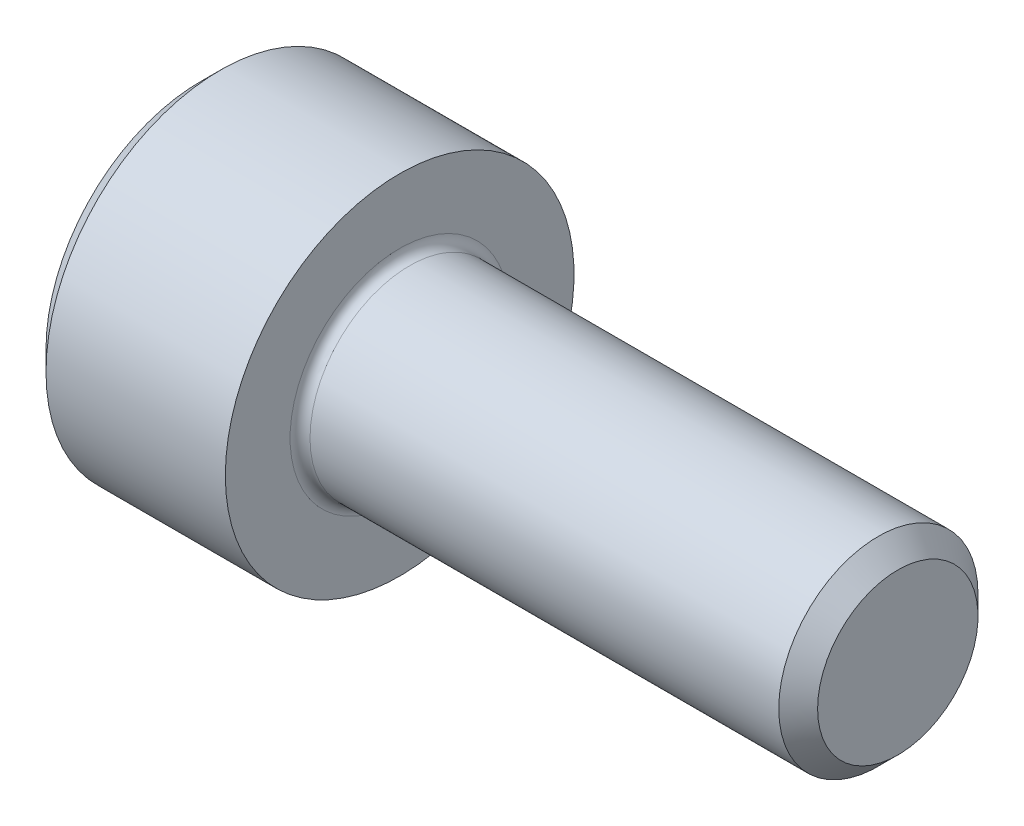
ISO-10303-21;
HEADER;
FILE_DESCRIPTION(('STEP AP214'),'2;1');
FILE_NAME('part.step','',(''),(''),'','','');
FILE_SCHEMA(('AUTOMOTIVE_DESIGN { 1 0 10303 214 1 1 1 1 }'));
ENDSEC;
DATA;
#1=APPLICATION_CONTEXT('core data for automotive mechanical design processes');
#2=APPLICATION_PROTOCOL_DEFINITION('international standard','automotive_design',2000,#1);
#3=PRODUCT_CONTEXT('',#1,'mechanical');
#4=PRODUCT('Part','Part','',(#3));
#5=PRODUCT_RELATED_PRODUCT_CATEGORY('part','',(#4));
#6=PRODUCT_DEFINITION_FORMATION('','',#4);
#7=PRODUCT_DEFINITION_CONTEXT('part definition',#1,'design');
#8=PRODUCT_DEFINITION('design','',#6,#7);
#9=PRODUCT_DEFINITION_SHAPE('','',#8);
#10=(LENGTH_UNIT() NAMED_UNIT(*) SI_UNIT(.MILLI.,.METRE.));
#11=(NAMED_UNIT(*) PLANE_ANGLE_UNIT() SI_UNIT($,.RADIAN.));
#12=(NAMED_UNIT(*) SI_UNIT($,.STERADIAN.) SOLID_ANGLE_UNIT());
#13=UNCERTAINTY_MEASURE_WITH_UNIT(LENGTH_MEASURE(1.E-05),#10,'distance_accuracy_value','');
#14=(GEOMETRIC_REPRESENTATION_CONTEXT(3) GLOBAL_UNCERTAINTY_ASSIGNED_CONTEXT((#13)) GLOBAL_UNIT_ASSIGNED_CONTEXT((#10,
#11,#12)) REPRESENTATION_CONTEXT('',''));
#15=CARTESIAN_POINT('',(0.,0.,0.));
#16=DIRECTION('',(0.,0.,1.));
#17=DIRECTION('',(1.,0.,0.));
#18=AXIS2_PLACEMENT_3D('',#15,#16,#17);
#19=CARTESIAN_POINT('',(0.,0.,0.));
#20=DIRECTION('',(-1.,0.,0.));
#21=DIRECTION('',(0.,0.,1.));
#22=AXIS2_PLACEMENT_3D('',#19,#20,#21);
#23=PLANE('',#22);
#24=DIRECTION('',(0.,-0.5,0.866025403784438));
#25=VECTOR('',#24,1.);
#26=CARTESIAN_POINT('',(0.,1.77304267668134,0.));
#27=LINE('',#26,#25);
#28=CARTESIAN_POINT('',(0.,1.77304267668134,0.));
#29=VERTEX_POINT('',#28);
#30=CARTESIAN_POINT('',(0.,0.886521338340669,1.5355));
#31=VERTEX_POINT('',#30);
#32=EDGE_CURVE('E386',#29,#31,#27,.T.);
#33=ORIENTED_EDGE('',*,*,#32,.T.);
#34=DIRECTION('',(0.,1.,0.));
#35=VECTOR('',#34,1.);
#36=CARTESIAN_POINT('',(0.,-0.886521338340673,1.5355));
#37=LINE('',#36,#35);
#38=CARTESIAN_POINT('',(0.,-0.886521338340673,1.5355));
#39=VERTEX_POINT('',#38);
#40=EDGE_CURVE('E130',#39,#31,#37,.T.);
#41=ORIENTED_EDGE('',*,*,#40,.F.);
#42=DIRECTION('',(0.,-0.500000000000001,-0.866025403784438));
#43=VECTOR('',#42,1.);
#44=CARTESIAN_POINT('',(0.,-0.886521338340673,1.5355));
#45=LINE('',#44,#43);
#46=CARTESIAN_POINT('',(0.,-1.77304267668135,0.));
#47=VERTEX_POINT('',#46);
#48=EDGE_CURVE('E389',#39,#47,#45,.T.);
#49=ORIENTED_EDGE('',*,*,#48,.T.);
#50=DIRECTION('',(0.,0.5,-0.866025403784439));
#51=VECTOR('',#50,1.);
#52=CARTESIAN_POINT('',(0.,-1.77304267668135,0.));
#53=LINE('',#52,#51);
#54=CARTESIAN_POINT('',(0.,-0.886521338340675,-1.5355));
#55=VERTEX_POINT('',#54);
#56=EDGE_CURVE('E392',#47,#55,#53,.T.);
#57=ORIENTED_EDGE('',*,*,#56,.T.);
#58=DIRECTION('',(0.,-1.,0.));
#59=VECTOR('',#58,1.);
#60=CARTESIAN_POINT('',(0.,0.886521338340666,-1.5355));
#61=LINE('',#60,#59);
#62=CARTESIAN_POINT('',(0.,0.886521338340666,-1.5355));
#63=VERTEX_POINT('',#62);
#64=EDGE_CURVE('E395',#63,#55,#61,.T.);
#65=ORIENTED_EDGE('',*,*,#64,.F.);
#66=DIRECTION('',(0.,-0.500000000000001,-0.866025403784438));
#67=VECTOR('',#66,1.);
#68=CARTESIAN_POINT('',(0.,1.77304267668134,0.));
#69=LINE('',#68,#67);
#70=EDGE_CURVE('E125',#29,#63,#69,.T.);
#71=ORIENTED_EDGE('',*,*,#70,.F.);
#72=EDGE_LOOP('',(#33,#41,#49,#57,#65,#71));
#73=FACE_BOUND('',#72,.T.);
#74=CARTESIAN_POINT('',(0.,0.,0.));
#75=DIRECTION('',(-1.,0.,0.));
#76=DIRECTION('',(0.,0.,1.));
#77=AXIS2_PLACEMENT_3D('',#74,#75,#76);
#78=CIRCLE('',#77,3.1);
#79=CARTESIAN_POINT('',(0.,0.,3.1));
#80=VERTEX_POINT('',#79);
#81=EDGE_CURVE('E141',#80,#80,#78,.T.);
#82=ORIENTED_EDGE('',*,*,#81,.T.);
#83=EDGE_LOOP('',(#82));
#84=FACE_BOUND('',#83,.T.);
#85=ADVANCED_FACE('F34',(#73,#84),#23,.T.);
#86=CARTESIAN_POINT('',(14.,1.61,0.));
#87=DIRECTION('',(1.,0.,0.));
#88=DIRECTION('',(0.,0.,-1.));
#89=AXIS2_PLACEMENT_3D('',#86,#87,#88);
#90=PLANE('',#89);
#91=CARTESIAN_POINT('',(14.,0.,0.));
#92=DIRECTION('',(-1.,0.,0.));
#93=DIRECTION('',(0.,0.,1.));
#94=AXIS2_PLACEMENT_3D('',#91,#92,#93);
#95=CIRCLE('',#94,1.61);
#96=CARTESIAN_POINT('',(14.,0.,1.61));
#97=VERTEX_POINT('',#96);
#98=EDGE_CURVE('E154',#97,#97,#95,.T.);
#99=ORIENTED_EDGE('',*,*,#98,.F.);
#100=EDGE_LOOP('',(#99));
#101=FACE_BOUND('',#100,.T.);
#102=ADVANCED_FACE('F175',(#101),#90,.T.);
#103=CARTESIAN_POINT('',(14.,0.,0.));
#104=DIRECTION('',(-1.,0.,0.));
#105=DIRECTION('',(0.,0.,1.));
#106=AXIS2_PLACEMENT_3D('',#103,#104,#105);
#107=CONICAL_SURFACE('',#106,1.61,0.785398163397184);
#108=CARTESIAN_POINT('',(13.6099999999999,0.,0.));
#109=DIRECTION('',(-1.,0.,0.));
#110=DIRECTION('',(0.,0.,1.));
#111=AXIS2_PLACEMENT_3D('',#108,#109,#110);
#112=CIRCLE('',#111,1.99999999999989);
#113=CARTESIAN_POINT('',(13.6099999999999,0.,1.99999999999989));
#114=VERTEX_POINT('',#113);
#115=EDGE_CURVE('E151',#114,#114,#112,.T.);
#116=ORIENTED_EDGE('',*,*,#115,.F.);
#117=EDGE_LOOP('',(#116));
#118=FACE_BOUND('',#117,.T.);
#119=ORIENTED_EDGE('',*,*,#98,.T.);
#120=EDGE_LOOP('',(#119));
#121=FACE_BOUND('',#120,.T.);
#122=ADVANCED_FACE('F181',(#118,#121),#107,.T.);
#123=CARTESIAN_POINT('',(-31.75,0.,0.));
#124=DIRECTION('',(-1.,0.,0.));
#125=DIRECTION('',(0.,0.,1.));
#126=AXIS2_PLACEMENT_3D('',#123,#124,#125);
#127=CYLINDRICAL_SURFACE('',#126,1.99999999999995);
#128=CARTESIAN_POINT('',(4.2,0.,0.));
#129=DIRECTION('',(1.,0.,0.));
#130=DIRECTION('',(0.,0.,-1.));
#131=AXIS2_PLACEMENT_3D('',#128,#129,#130);
#132=CIRCLE('',#131,1.99999999999995);
#133=CARTESIAN_POINT('',(4.2,0.,-1.99999999999995));
#134=VERTEX_POINT('',#133);
#135=EDGE_CURVE('E11',#134,#134,#132,.T.);
#136=ORIENTED_EDGE('',*,*,#135,.T.);
#137=EDGE_LOOP('',(#136));
#138=FACE_BOUND('',#137,.T.);
#139=ORIENTED_EDGE('',*,*,#115,.T.);
#140=EDGE_LOOP('',(#139));
#141=FACE_BOUND('',#140,.T.);
#142=ADVANCED_FACE('F192',(#138,#141),#127,.T.);
#143=CARTESIAN_POINT('',(4.,3.5,0.));
#144=DIRECTION('',(1.,0.,0.));
#145=DIRECTION('',(0.,0.,-1.));
#146=AXIS2_PLACEMENT_3D('',#143,#144,#145);
#147=PLANE('',#146);
#148=CARTESIAN_POINT('',(4.,0.,0.));
#149=DIRECTION('',(1.,0.,0.));
#150=DIRECTION('',(0.,0.,-1.));
#151=AXIS2_PLACEMENT_3D('',#148,#149,#150);
#152=CIRCLE('',#151,2.19999999999995);
#153=CARTESIAN_POINT('',(4.,0.,-2.19999999999995));
#154=VERTEX_POINT('',#153);
#155=EDGE_CURVE('E42',#154,#154,#152,.F.);
#156=ORIENTED_EDGE('',*,*,#155,.T.);
#157=EDGE_LOOP('',(#156));
#158=FACE_BOUND('',#157,.T.);
#159=CARTESIAN_POINT('',(4.,0.,0.));
#160=DIRECTION('',(-1.,0.,0.));
#161=DIRECTION('',(0.,0.,1.));
#162=AXIS2_PLACEMENT_3D('',#159,#160,#161);
#163=CIRCLE('',#162,3.5);
#164=CARTESIAN_POINT('',(4.,0.,3.5));
#165=VERTEX_POINT('',#164);
#166=EDGE_CURVE('E148',#165,#165,#163,.T.);
#167=ORIENTED_EDGE('',*,*,#166,.F.);
#168=EDGE_LOOP('',(#167));
#169=FACE_BOUND('',#168,.T.);
#170=ADVANCED_FACE('F159',(#158,#169),#147,.T.);
#171=CARTESIAN_POINT('',(-31.75,0.,0.));
#172=DIRECTION('',(-1.,0.,0.));
#173=DIRECTION('',(0.,0.,1.));
#174=AXIS2_PLACEMENT_3D('',#171,#172,#173);
#175=CYLINDRICAL_SURFACE('',#174,3.5);
#176=ORIENTED_EDGE('',*,*,#166,.T.);
#177=EDGE_LOOP('',(#176));
#178=FACE_BOUND('',#177,.T.);
#179=CARTESIAN_POINT('',(0.399999999999998,0.,0.));
#180=DIRECTION('',(-1.,0.,0.));
#181=DIRECTION('',(0.,0.,1.));
#182=AXIS2_PLACEMENT_3D('',#179,#180,#181);
#183=CIRCLE('',#182,3.5);
#184=CARTESIAN_POINT('',(0.399999999999998,0.,3.5));
#185=VERTEX_POINT('',#184);
#186=EDGE_CURVE('E145',#185,#185,#183,.T.);
#187=ORIENTED_EDGE('',*,*,#186,.F.);
#188=EDGE_LOOP('',(#187));
#189=FACE_BOUND('',#188,.T.);
#190=ADVANCED_FACE('F170',(#178,#189),#175,.T.);
#191=CARTESIAN_POINT('',(0.,0.,0.));
#192=DIRECTION('',(1.,0.,0.));
#193=DIRECTION('',(0.,0.,-1.));
#194=AXIS2_PLACEMENT_3D('',#191,#192,#193);
#195=CONICAL_SURFACE('',#194,3.1,0.78539816339745);
#196=ORIENTED_EDGE('',*,*,#186,.T.);
#197=EDGE_LOOP('',(#196));
#198=FACE_BOUND('',#197,.T.);
#199=ORIENTED_EDGE('',*,*,#81,.F.);
#200=EDGE_LOOP('',(#199));
#201=FACE_BOUND('',#200,.T.);
#202=ADVANCED_FACE('F163',(#198,#201),#195,.T.);
#203=CARTESIAN_POINT('',(4.2,0.,0.));
#204=DIRECTION('',(1.,0.,0.));
#205=DIRECTION('',(0.,0.,-1.));
#206=AXIS2_PLACEMENT_3D('',#203,#204,#205);
#207=TOROIDAL_SURFACE('',#206,2.19999999999995,0.2);
#208=ORIENTED_EDGE('',*,*,#135,.F.);
#209=EDGE_LOOP('',(#208));
#210=FACE_BOUND('',#209,.T.);
#211=ORIENTED_EDGE('',*,*,#155,.F.);
#212=EDGE_LOOP('',(#211));
#213=FACE_BOUND('',#212,.T.);
#214=ADVANCED_FACE('F36',(#210,#213),#207,.F.);
#215=CARTESIAN_POINT('',(2.,1.77304267668134,0.));
#216=DIRECTION('',(0.,-0.866025403784439,-0.5));
#217=DIRECTION('',(0.,0.5,-0.866025403784438));
#218=AXIS2_PLACEMENT_3D('',#215,#216,#217);
#219=PLANE('',#218);
#220=ORIENTED_EDGE('',*,*,#32,.F.);
#221=DIRECTION('',(-1.,0.,0.));
#222=VECTOR('',#221,1.);
#223=CARTESIAN_POINT('',(2.,1.77304267668134,0.));
#224=LINE('',#223,#222);
#225=CARTESIAN_POINT('',(2.,1.77304267668134,0.));
#226=VERTEX_POINT('',#225);
#227=EDGE_CURVE('E376',#226,#29,#224,.T.);
#228=ORIENTED_EDGE('',*,*,#227,.F.);
#229=DIRECTION('',(0.,-0.5,0.866025403784438));
#230=VECTOR('',#229,1.);
#231=CARTESIAN_POINT('',(2.,1.77304267668134,0.));
#232=LINE('',#231,#230);
#233=CARTESIAN_POINT('',(2.,1.329782007511,0.767749999999999));
#234=VERTEX_POINT('',#233);
#235=EDGE_CURVE('E117',#226,#234,#232,.T.);
#236=ORIENTED_EDGE('',*,*,#235,.T.);
#237=CARTESIAN_POINT('',(2.,0.886521338340669,1.5355));
#238=VERTEX_POINT('',#237);
#239=EDGE_CURVE('E108',#234,#238,#232,.T.);
#240=ORIENTED_EDGE('',*,*,#239,.T.);
#241=DIRECTION('',(-1.,0.,0.));
#242=VECTOR('',#241,1.);
#243=CARTESIAN_POINT('',(2.,0.886521338340669,1.5355));
#244=LINE('',#243,#242);
#245=EDGE_CURVE('E122',#238,#31,#244,.T.);
#246=ORIENTED_EDGE('',*,*,#245,.T.);
#247=EDGE_LOOP('',(#220,#228,#236,#240,#246));
#248=FACE_BOUND('',#247,.T.);
#249=ADVANCED_FACE('F121',(#248),#219,.T.);
#250=CARTESIAN_POINT('',(2.,-0.886521338340673,1.5355));
#251=DIRECTION('',(0.,0.,1.));
#252=DIRECTION('',(0.,-1.,0.));
#253=AXIS2_PLACEMENT_3D('',#250,#251,#252);
#254=PLANE('',#253);
#255=ORIENTED_EDGE('',*,*,#40,.T.);
#256=ORIENTED_EDGE('',*,*,#245,.F.);
#257=DIRECTION('',(0.,1.,0.));
#258=VECTOR('',#257,1.);
#259=CARTESIAN_POINT('',(2.,-0.886521338340673,1.5355));
#260=LINE('',#259,#258);
#261=CARTESIAN_POINT('',(2.,0.,1.5355));
#262=VERTEX_POINT('',#261);
#263=EDGE_CURVE('E105',#262,#238,#260,.T.);
#264=ORIENTED_EDGE('',*,*,#263,.F.);
#265=CARTESIAN_POINT('',(2.,-0.886521338340673,1.5355));
#266=VERTEX_POINT('',#265);
#267=EDGE_CURVE('E116',#266,#262,#260,.T.);
#268=ORIENTED_EDGE('',*,*,#267,.F.);
#269=DIRECTION('',(-1.,0.,0.));
#270=VECTOR('',#269,1.);
#271=CARTESIAN_POINT('',(2.,-0.886521338340673,1.5355));
#272=LINE('',#271,#270);
#273=EDGE_CURVE('E132',#266,#39,#272,.T.);
#274=ORIENTED_EDGE('',*,*,#273,.T.);
#275=EDGE_LOOP('',(#255,#256,#264,#268,#274));
#276=FACE_BOUND('',#275,.T.);
#277=ADVANCED_FACE('F127',(#276),#254,.F.);
#278=CARTESIAN_POINT('',(2.,-0.886521338340673,1.5355));
#279=DIRECTION('',(0.,0.866025403784438,-0.500000000000001));
#280=DIRECTION('',(0.,0.500000000000001,0.866025403784438));
#281=AXIS2_PLACEMENT_3D('',#278,#279,#280);
#282=PLANE('',#281);
#283=ORIENTED_EDGE('',*,*,#48,.F.);
#284=ORIENTED_EDGE('',*,*,#273,.F.);
#285=DIRECTION('',(0.,-0.500000000000001,-0.866025403784438));
#286=VECTOR('',#285,1.);
#287=CARTESIAN_POINT('',(2.,-0.886521338340673,1.5355));
#288=LINE('',#287,#286);
#289=CARTESIAN_POINT('',(2.,-1.32978200751101,0.767750000000003));
#290=VERTEX_POINT('',#289);
#291=EDGE_CURVE('E415',#266,#290,#288,.T.);
#292=ORIENTED_EDGE('',*,*,#291,.T.);
#293=CARTESIAN_POINT('',(2.,-1.77304267668135,0.));
#294=VERTEX_POINT('',#293);
#295=EDGE_CURVE('E404',#290,#294,#288,.T.);
#296=ORIENTED_EDGE('',*,*,#295,.T.);
#297=DIRECTION('',(-1.,0.,0.));
#298=VECTOR('',#297,1.);
#299=CARTESIAN_POINT('',(2.,-1.77304267668135,0.));
#300=LINE('',#299,#298);
#301=EDGE_CURVE('E137',#294,#47,#300,.T.);
#302=ORIENTED_EDGE('',*,*,#301,.T.);
#303=EDGE_LOOP('',(#283,#284,#292,#296,#302));
#304=FACE_BOUND('',#303,.T.);
#305=ADVANCED_FACE('F267',(#304),#282,.T.);
#306=CARTESIAN_POINT('',(2.,-1.77304267668135,0.));
#307=DIRECTION('',(0.,0.866025403784439,0.5));
#308=DIRECTION('',(0.,-0.5,0.866025403784439));
#309=AXIS2_PLACEMENT_3D('',#306,#307,#308);
#310=PLANE('',#309);
#311=ORIENTED_EDGE('',*,*,#56,.F.);
#312=ORIENTED_EDGE('',*,*,#301,.F.);
#313=DIRECTION('',(0.,0.5,-0.866025403784439));
#314=VECTOR('',#313,1.);
#315=CARTESIAN_POINT('',(2.,-1.77304267668135,0.));
#316=LINE('',#315,#314);
#317=CARTESIAN_POINT('',(2.,-1.32978200751101,-0.767750000000002));
#318=VERTEX_POINT('',#317);
#319=EDGE_CURVE('E382',#294,#318,#316,.T.);
#320=ORIENTED_EDGE('',*,*,#319,.T.);
#321=CARTESIAN_POINT('',(2.,-0.886521338340675,-1.5355));
#322=VERTEX_POINT('',#321);
#323=EDGE_CURVE('E414',#318,#322,#316,.T.);
#324=ORIENTED_EDGE('',*,*,#323,.T.);
#325=DIRECTION('',(-1.,0.,0.));
#326=VECTOR('',#325,1.);
#327=CARTESIAN_POINT('',(2.,-0.886521338340675,-1.5355));
#328=LINE('',#327,#326);
#329=EDGE_CURVE('E375',#322,#55,#328,.T.);
#330=ORIENTED_EDGE('',*,*,#329,.T.);
#331=EDGE_LOOP('',(#311,#312,#320,#324,#330));
#332=FACE_BOUND('',#331,.T.);
#333=ADVANCED_FACE('F275',(#332),#310,.T.);
#334=CARTESIAN_POINT('',(2.,0.886521338340666,-1.5355));
#335=DIRECTION('',(0.,0.,-1.));
#336=DIRECTION('',(0.,1.,0.));
#337=AXIS2_PLACEMENT_3D('',#334,#335,#336);
#338=PLANE('',#337);
#339=ORIENTED_EDGE('',*,*,#64,.T.);
#340=ORIENTED_EDGE('',*,*,#329,.F.);
#341=DIRECTION('',(0.,-1.,0.));
#342=VECTOR('',#341,1.);
#343=CARTESIAN_POINT('',(2.,0.886521338340666,-1.5355));
#344=LINE('',#343,#342);
#345=CARTESIAN_POINT('',(2.,0.,-1.5355));
#346=VERTEX_POINT('',#345);
#347=EDGE_CURVE('E379',#346,#322,#344,.T.);
#348=ORIENTED_EDGE('',*,*,#347,.F.);
#349=CARTESIAN_POINT('',(2.,0.886521338340666,-1.5355));
#350=VERTEX_POINT('',#349);
#351=EDGE_CURVE('E49',#350,#346,#344,.T.);
#352=ORIENTED_EDGE('',*,*,#351,.F.);
#353=DIRECTION('',(-1.,0.,0.));
#354=VECTOR('',#353,1.);
#355=CARTESIAN_POINT('',(2.,0.886521338340666,-1.5355));
#356=LINE('',#355,#354);
#357=EDGE_CURVE('E372',#350,#63,#356,.T.);
#358=ORIENTED_EDGE('',*,*,#357,.T.);
#359=EDGE_LOOP('',(#339,#340,#348,#352,#358));
#360=FACE_BOUND('',#359,.T.);
#361=ADVANCED_FACE('F284',(#360),#338,.F.);
#362=CARTESIAN_POINT('',(2.,1.77304267668134,0.));
#363=DIRECTION('',(0.,0.866025403784438,-0.500000000000001));
#364=DIRECTION('',(0.,0.500000000000001,0.866025403784438));
#365=AXIS2_PLACEMENT_3D('',#362,#363,#364);
#366=PLANE('',#365);
#367=ORIENTED_EDGE('',*,*,#70,.T.);
#368=ORIENTED_EDGE('',*,*,#357,.F.);
#369=DIRECTION('',(0.,-0.500000000000001,-0.866025403784438));
#370=VECTOR('',#369,1.);
#371=CARTESIAN_POINT('',(2.,1.77304267668134,0.));
#372=LINE('',#371,#370);
#373=CARTESIAN_POINT('',(2.,1.329782007511,-0.767750000000002));
#374=VERTEX_POINT('',#373);
#375=EDGE_CURVE('E362',#374,#350,#372,.T.);
#376=ORIENTED_EDGE('',*,*,#375,.F.);
#377=EDGE_CURVE('E368',#226,#374,#372,.T.);
#378=ORIENTED_EDGE('',*,*,#377,.F.);
#379=ORIENTED_EDGE('',*,*,#227,.T.);
#380=EDGE_LOOP('',(#367,#368,#376,#378,#379));
#381=FACE_BOUND('',#380,.T.);
#382=ADVANCED_FACE('F293',(#381),#366,.F.);
#383=CARTESIAN_POINT('',(2.,1.77304267668134,0.));
#384=DIRECTION('',(1.,0.,0.));
#385=DIRECTION('',(0.,0.,-1.));
#386=AXIS2_PLACEMENT_3D('',#383,#384,#385);
#387=PLANE('',#386);
#388=ORIENTED_EDGE('',*,*,#347,.T.);
#389=ORIENTED_EDGE('',*,*,#323,.F.);
#390=CARTESIAN_POINT('',(2.,0.,0.));
#391=DIRECTION('',(-1.,0.,0.));
#392=DIRECTION('',(0.,0.,1.));
#393=AXIS2_PLACEMENT_3D('',#390,#391,#392);
#394=CIRCLE('',#393,1.5355);
#395=EDGE_CURVE('E410',#346,#318,#394,.T.);
#396=ORIENTED_EDGE('',*,*,#395,.F.);
#397=EDGE_LOOP('',(#388,#389,#396));
#398=FACE_BOUND('',#397,.T.);
#399=ADVANCED_FACE('F302',(#398),#387,.F.);
#400=ORIENTED_EDGE('',*,*,#319,.F.);
#401=ORIENTED_EDGE('',*,*,#295,.F.);
#402=EDGE_CURVE('E135',#318,#290,#394,.T.);
#403=ORIENTED_EDGE('',*,*,#402,.F.);
#404=EDGE_LOOP('',(#400,#401,#403));
#405=FACE_BOUND('',#404,.T.);
#406=ADVANCED_FACE('F311',(#405),#387,.F.);
#407=ORIENTED_EDGE('',*,*,#291,.F.);
#408=ORIENTED_EDGE('',*,*,#267,.T.);
#409=EDGE_CURVE('E131',#290,#262,#394,.T.);
#410=ORIENTED_EDGE('',*,*,#409,.F.);
#411=EDGE_LOOP('',(#407,#408,#410));
#412=FACE_BOUND('',#411,.T.);
#413=ADVANCED_FACE('F320',(#412),#387,.F.);
#414=ORIENTED_EDGE('',*,*,#263,.T.);
#415=ORIENTED_EDGE('',*,*,#239,.F.);
#416=EDGE_CURVE('E111',#262,#234,#394,.T.);
#417=ORIENTED_EDGE('',*,*,#416,.F.);
#418=EDGE_LOOP('',(#414,#415,#417));
#419=FACE_BOUND('',#418,.T.);
#420=ADVANCED_FACE('F107',(#419),#387,.F.);
#421=ORIENTED_EDGE('',*,*,#235,.F.);
#422=ORIENTED_EDGE('',*,*,#377,.T.);
#423=EDGE_CURVE('E142',#234,#374,#394,.T.);
#424=ORIENTED_EDGE('',*,*,#423,.F.);
#425=EDGE_LOOP('',(#421,#422,#424));
#426=FACE_BOUND('',#425,.T.);
#427=ADVANCED_FACE('F335',(#426),#387,.F.);
#428=ORIENTED_EDGE('',*,*,#375,.T.);
#429=ORIENTED_EDGE('',*,*,#351,.T.);
#430=EDGE_CURVE('E365',#374,#346,#394,.T.);
#431=ORIENTED_EDGE('',*,*,#430,.F.);
#432=EDGE_LOOP('',(#428,#429,#431));
#433=FACE_BOUND('',#432,.T.);
#434=ADVANCED_FACE('F250',(#433),#387,.F.);
#435=CARTESIAN_POINT('',(2.,0.,0.));
#436=DIRECTION('',(-1.,0.,0.));
#437=DIRECTION('',(0.,0.,1.));
#438=AXIS2_PLACEMENT_3D('',#435,#436,#437);
#439=CONICAL_SURFACE('',#438,1.5355,1.04719755119659);
#440=CARTESIAN_POINT('',(2.88652133834068,0.,0.));
#441=VERTEX_POINT('',#440);
#442=VERTEX_LOOP('',#441);
#443=FACE_BOUND('',#442,.T.);
#444=ORIENTED_EDGE('',*,*,#416,.T.);
#445=ORIENTED_EDGE('',*,*,#423,.T.);
#446=ORIENTED_EDGE('',*,*,#430,.T.);
#447=ORIENTED_EDGE('',*,*,#395,.T.);
#448=ORIENTED_EDGE('',*,*,#402,.T.);
#449=ORIENTED_EDGE('',*,*,#409,.T.);
#450=EDGE_LOOP('',(#444,#445,#446,#447,#448,#449));
#451=FACE_BOUND('',#450,.T.);
#452=ADVANCED_FACE('F185',(#443,#451),#439,.F.);
#453=CLOSED_SHELL('',(#85,#102,#122,#142,#170,#190,#202,#214,#249,#277,#305,#333,#361,#382,#399,
#406,#413,#420,#427,#434,#452));
#454=MANIFOLD_SOLID_BREP('B2',#453);
#455=ADVANCED_BREP_SHAPE_REPRESENTATION('',(#18,#454),#14);
#456=SHAPE_DEFINITION_REPRESENTATION(#9,#455);
ENDSEC;
END-ISO-10303-21;
